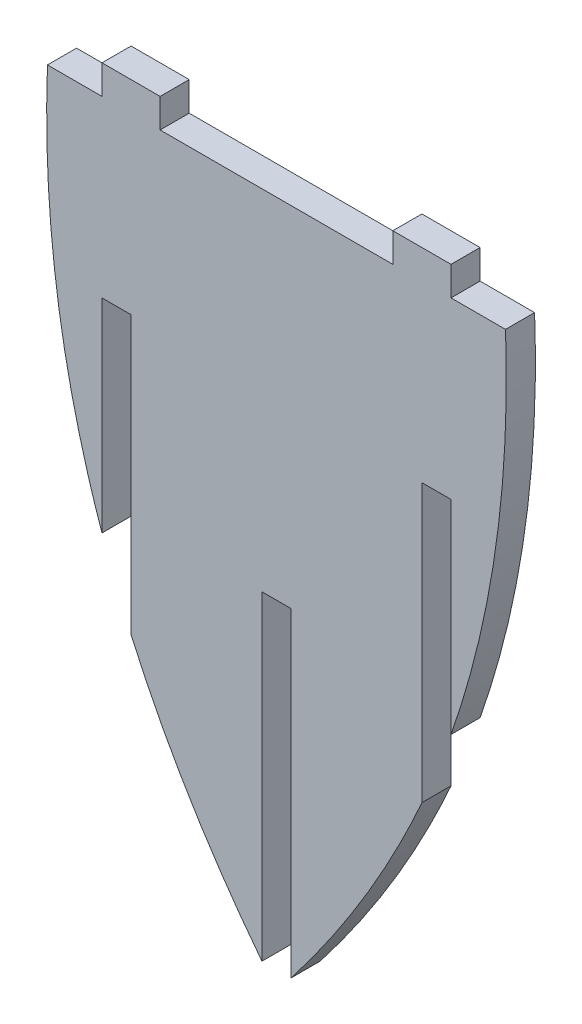
ISO-10303-21;
HEADER;
FILE_DESCRIPTION(('STEP AP214'),'2;1');
FILE_NAME('part.step','',(''),(''),'','','');
FILE_SCHEMA(('AUTOMOTIVE_DESIGN { 1 0 10303 214 1 1 1 1 }'));
ENDSEC;
DATA;
#1=APPLICATION_CONTEXT('core data for automotive mechanical design processes');
#2=APPLICATION_PROTOCOL_DEFINITION('international standard','automotive_design',2000,#1);
#3=PRODUCT_CONTEXT('',#1,'mechanical');
#4=PRODUCT('Part','Part','',(#3));
#5=PRODUCT_RELATED_PRODUCT_CATEGORY('part','',(#4));
#6=PRODUCT_DEFINITION_FORMATION('','',#4);
#7=PRODUCT_DEFINITION_CONTEXT('part definition',#1,'design');
#8=PRODUCT_DEFINITION('design','',#6,#7);
#9=PRODUCT_DEFINITION_SHAPE('','',#8);
#10=(LENGTH_UNIT() NAMED_UNIT(*) SI_UNIT(.MILLI.,.METRE.));
#11=(NAMED_UNIT(*) PLANE_ANGLE_UNIT() SI_UNIT($,.RADIAN.));
#12=(NAMED_UNIT(*) SI_UNIT($,.STERADIAN.) SOLID_ANGLE_UNIT());
#13=UNCERTAINTY_MEASURE_WITH_UNIT(LENGTH_MEASURE(1.E-05),#10,'distance_accuracy_value','');
#14=(GEOMETRIC_REPRESENTATION_CONTEXT(3) GLOBAL_UNCERTAINTY_ASSIGNED_CONTEXT((#13)) GLOBAL_UNIT_ASSIGNED_CONTEXT((#10,
#11,#12)) REPRESENTATION_CONTEXT('',''));
#15=CARTESIAN_POINT('',(0.,0.,0.));
#16=DIRECTION('',(0.,0.,1.));
#17=DIRECTION('',(1.,0.,0.));
#18=AXIS2_PLACEMENT_3D('',#15,#16,#17);
#19=CARTESIAN_POINT('',(-6.35,330.2,6.35));
#20=DIRECTION('',(0.,1.,0.));
#21=DIRECTION('',(0.,0.,1.));
#22=AXIS2_PLACEMENT_3D('',#19,#20,#21);
#23=PLANE('',#22);
#24=DIRECTION('',(1.,0.,0.));
#25=VECTOR('',#24,1.);
#26=CARTESIAN_POINT('',(-6.35,330.2,0.));
#27=LINE('',#26,#25);
#28=CARTESIAN_POINT('',(-6.35,330.2,0.));
#29=VERTEX_POINT('',#28);
#30=CARTESIAN_POINT('',(0.,330.2,0.));
#31=VERTEX_POINT('',#30);
#32=EDGE_CURVE('E328',#29,#31,#27,.T.);
#33=ORIENTED_EDGE('',*,*,#32,.T.);
#34=DIRECTION('',(0.,0.,-1.));
#35=VECTOR('',#34,1.);
#36=CARTESIAN_POINT('',(0.,330.2,6.35));
#37=LINE('',#36,#35);
#38=CARTESIAN_POINT('',(0.,330.2,6.35));
#39=VERTEX_POINT('',#38);
#40=EDGE_CURVE('E11',#39,#31,#37,.T.);
#41=ORIENTED_EDGE('',*,*,#40,.F.);
#42=DIRECTION('',(1.,0.,0.));
#43=VECTOR('',#42,1.);
#44=CARTESIAN_POINT('',(-6.35,330.2,6.35));
#45=LINE('',#44,#43);
#46=CARTESIAN_POINT('',(-6.35,330.2,6.35));
#47=VERTEX_POINT('',#46);
#48=EDGE_CURVE('E382',#47,#39,#45,.T.);
#49=ORIENTED_EDGE('',*,*,#48,.F.);
#50=DIRECTION('',(0.,0.,-1.));
#51=VECTOR('',#50,1.);
#52=CARTESIAN_POINT('',(-6.35,330.2,6.35));
#53=LINE('',#52,#51);
#54=EDGE_CURVE('E207',#47,#29,#53,.T.);
#55=ORIENTED_EDGE('',*,*,#54,.T.);
#56=EDGE_LOOP('',(#33,#41,#49,#55));
#57=FACE_BOUND('',#56,.T.);
#58=ADVANCED_FACE('F31',(#57),#23,.F.);
#59=CARTESIAN_POINT('',(0.,330.2,6.35));
#60=DIRECTION('',(1.,0.,0.));
#61=DIRECTION('',(0.,1.,0.));
#62=AXIS2_PLACEMENT_3D('',#59,#60,#61);
#63=PLANE('',#62);
#64=DIRECTION('',(0.,-1.,0.));
#65=VECTOR('',#64,1.);
#66=CARTESIAN_POINT('',(0.,330.2,0.));
#67=LINE('',#66,#65);
#68=CARTESIAN_POINT('',(0.,260.35,0.));
#69=VERTEX_POINT('',#68);
#70=EDGE_CURVE('E322',#31,#69,#67,.T.);
#71=ORIENTED_EDGE('',*,*,#70,.T.);
#72=DIRECTION('',(0.,0.,-1.));
#73=VECTOR('',#72,1.);
#74=CARTESIAN_POINT('',(0.,260.35,6.35));
#75=LINE('',#74,#73);
#76=CARTESIAN_POINT('',(0.,260.35,6.35));
#77=VERTEX_POINT('',#76);
#78=EDGE_CURVE('E39',#77,#69,#75,.T.);
#79=ORIENTED_EDGE('',*,*,#78,.F.);
#80=DIRECTION('',(0.,-1.,0.));
#81=VECTOR('',#80,1.);
#82=CARTESIAN_POINT('',(0.,330.2,6.35));
#83=LINE('',#82,#81);
#84=EDGE_CURVE('E132',#39,#77,#83,.T.);
#85=ORIENTED_EDGE('',*,*,#84,.F.);
#86=ORIENTED_EDGE('',*,*,#40,.T.);
#87=EDGE_LOOP('',(#71,#79,#85,#86));
#88=FACE_BOUND('',#87,.T.);
#89=ADVANCED_FACE('F403',(#88),#63,.F.);
#90=CARTESIAN_POINT('',(0.,260.35,6.35));
#91=CARTESIAN_POINT('',(17.5727422641235,282.971699720623,6.35));
#92=CARTESIAN_POINT('',(28.5750000002258,307.792730185393,6.35));
#93=B_SPLINE_CURVE_WITH_KNOTS('',2,(#90,#91,#92),.UNSPECIFIED.,.F.,.F.,(3,3),(0.647499935298557,
1.),.UNSPECIFIED.);
#94=DIRECTION('',(0.,0.,-1.));
#95=VECTOR('',#94,1.);
#96=SURFACE_OF_LINEAR_EXTRUSION('',#93,#95);
#97=CARTESIAN_POINT('',(0.,260.35,0.));
#98=CARTESIAN_POINT('',(17.5727422641235,282.971699720623,0.));
#99=CARTESIAN_POINT('',(28.5750000002258,307.792730185393,0.));
#100=B_SPLINE_CURVE_WITH_KNOTS('',2,(#97,#98,#99),.UNSPECIFIED.,.F.,.F.,(3,3),
(0.647499935298557,1.),.UNSPECIFIED.);
#101=CARTESIAN_POINT('',(28.5750000002258,307.792730185393,0.));
#102=VERTEX_POINT('',#101);
#103=EDGE_CURVE('E316',#69,#102,#100,.T.);
#104=ORIENTED_EDGE('',*,*,#103,.T.);
#105=DIRECTION('',(0.,0.,-1.));
#106=VECTOR('',#105,1.);
#107=CARTESIAN_POINT('',(28.5750000002258,307.792730185393,6.35));
#108=LINE('',#107,#106);
#109=CARTESIAN_POINT('',(28.5750000002258,307.792730185393,6.35));
#110=VERTEX_POINT('',#109);
#111=EDGE_CURVE('E308',#110,#102,#108,.T.);
#112=ORIENTED_EDGE('',*,*,#111,.F.);
#113=EDGE_CURVE('E317',#77,#110,#93,.T.);
#114=ORIENTED_EDGE('',*,*,#113,.F.);
#115=ORIENTED_EDGE('',*,*,#78,.T.);
#116=EDGE_LOOP('',(#104,#112,#114,#115));
#117=FACE_BOUND('',#116,.T.);
#118=ADVANCED_FACE('F314',(#117),#96,.F.);
#119=CARTESIAN_POINT('',(28.5750000002258,368.3,6.35));
#120=DIRECTION('',(-1.,0.,0.));
#121=DIRECTION('',(0.,-1.,0.));
#122=AXIS2_PLACEMENT_3D('',#119,#120,#121);
#123=PLANE('',#122);
#124=DIRECTION('',(0.,1.,0.));
#125=VECTOR('',#124,1.);
#126=CARTESIAN_POINT('',(28.5750000002258,368.3,0.));
#127=LINE('',#126,#125);
#128=CARTESIAN_POINT('',(28.5750000002258,368.3,0.));
#129=VERTEX_POINT('',#128);
#130=EDGE_CURVE('E324',#102,#129,#127,.T.);
#131=ORIENTED_EDGE('',*,*,#130,.T.);
#132=DIRECTION('',(0.,0.,-1.));
#133=VECTOR('',#132,1.);
#134=CARTESIAN_POINT('',(28.5750000002258,368.3,6.35));
#135=LINE('',#134,#133);
#136=CARTESIAN_POINT('',(28.5750000002258,368.3,6.35));
#137=VERTEX_POINT('',#136);
#138=EDGE_CURVE('E305',#137,#129,#135,.T.);
#139=ORIENTED_EDGE('',*,*,#138,.F.);
#140=DIRECTION('',(0.,1.,0.));
#141=VECTOR('',#140,1.);
#142=CARTESIAN_POINT('',(28.5750000002258,368.3,6.35));
#143=LINE('',#142,#141);
#144=EDGE_CURVE('E394',#110,#137,#143,.T.);
#145=ORIENTED_EDGE('',*,*,#144,.F.);
#146=ORIENTED_EDGE('',*,*,#111,.T.);
#147=EDGE_LOOP('',(#131,#139,#145,#146));
#148=FACE_BOUND('',#147,.T.);
#149=ADVANCED_FACE('F402',(#148),#123,.F.);
#150=CARTESIAN_POINT('',(34.9250000002258,368.3,6.35));
#151=DIRECTION('',(0.,1.,0.));
#152=DIRECTION('',(0.,0.,1.));
#153=AXIS2_PLACEMENT_3D('',#150,#151,#152);
#154=PLANE('',#153);
#155=DIRECTION('',(1.,0.,0.));
#156=VECTOR('',#155,1.);
#157=CARTESIAN_POINT('',(34.9250000002258,368.3,0.));
#158=LINE('',#157,#156);
#159=CARTESIAN_POINT('',(34.9250000002258,368.3,0.));
#160=VERTEX_POINT('',#159);
#161=EDGE_CURVE('E326',#129,#160,#158,.T.);
#162=ORIENTED_EDGE('',*,*,#161,.T.);
#163=DIRECTION('',(0.,0.,-1.));
#164=VECTOR('',#163,1.);
#165=CARTESIAN_POINT('',(34.9250000002258,368.3,6.35));
#166=LINE('',#165,#164);
#167=CARTESIAN_POINT('',(34.9250000002258,368.3,6.35));
#168=VERTEX_POINT('',#167);
#169=EDGE_CURVE('E302',#168,#160,#166,.T.);
#170=ORIENTED_EDGE('',*,*,#169,.F.);
#171=DIRECTION('',(1.,0.,0.));
#172=VECTOR('',#171,1.);
#173=CARTESIAN_POINT('',(34.9250000002258,368.3,6.35));
#174=LINE('',#173,#172);
#175=EDGE_CURVE('E647',#137,#168,#174,.T.);
#176=ORIENTED_EDGE('',*,*,#175,.F.);
#177=ORIENTED_EDGE('',*,*,#138,.T.);
#178=EDGE_LOOP('',(#162,#170,#176,#177));
#179=FACE_BOUND('',#178,.T.);
#180=ADVANCED_FACE('F430',(#179),#154,.F.);
#181=CARTESIAN_POINT('',(34.925,323.85,6.35));
#182=DIRECTION('',(1.,-5.08092505701625E-12,0.));
#183=DIRECTION('',(5.08092505701625E-12,1.,0.));
#184=AXIS2_PLACEMENT_3D('',#181,#182,#183);
#185=PLANE('',#184);
#186=DIRECTION('',(-5.08092505701625E-12,-1.,0.));
#187=VECTOR('',#186,1.);
#188=CARTESIAN_POINT('',(34.925,323.85,0.));
#189=LINE('',#188,#187);
#190=CARTESIAN_POINT('',(34.925,323.85,0.));
#191=VERTEX_POINT('',#190);
#192=EDGE_CURVE('E337',#160,#191,#189,.T.);
#193=ORIENTED_EDGE('',*,*,#192,.T.);
#194=DIRECTION('',(0.,0.,-1.));
#195=VECTOR('',#194,1.);
#196=CARTESIAN_POINT('',(34.925,323.85,6.35));
#197=LINE('',#196,#195);
#198=CARTESIAN_POINT('',(34.925,323.85,6.35));
#199=VERTEX_POINT('',#198);
#200=EDGE_CURVE('E299',#199,#191,#197,.T.);
#201=ORIENTED_EDGE('',*,*,#200,.F.);
#202=DIRECTION('',(-5.08092505701625E-12,-1.,0.));
#203=VECTOR('',#202,1.);
#204=CARTESIAN_POINT('',(34.925,323.85,6.35));
#205=LINE('',#204,#203);
#206=EDGE_CURVE('E643',#168,#199,#205,.T.);
#207=ORIENTED_EDGE('',*,*,#206,.F.);
#208=ORIENTED_EDGE('',*,*,#169,.T.);
#209=EDGE_LOOP('',(#193,#201,#207,#208));
#210=FACE_BOUND('',#209,.T.);
#211=ADVANCED_FACE('F439',(#210),#185,.F.);
#212=CARTESIAN_POINT('',(34.925,323.85,6.35));
#213=CARTESIAN_POINT('',(48.4445147876115,362.591265004155,6.35));
#214=CARTESIAN_POINT('',(46.825,406.4,6.35));
#215=B_SPLINE_CURVE_WITH_KNOTS('',2,(#212,#213,#214),.UNSPECIFIED.,.F.,.F.,(3,3),(0.,
0.535068668625723),.UNSPECIFIED.);
#216=DIRECTION('',(0.,0.,-1.));
#217=VECTOR('',#216,1.);
#218=SURFACE_OF_LINEAR_EXTRUSION('',#215,#217);
#219=CARTESIAN_POINT('',(34.925,323.85,0.));
#220=CARTESIAN_POINT('',(48.4445147876115,362.591265004155,0.));
#221=CARTESIAN_POINT('',(46.825,406.4,0.));
#222=B_SPLINE_CURVE_WITH_KNOTS('',2,(#219,#220,#221),.UNSPECIFIED.,.F.,.F.,(3,3),(0.,
0.535068668625723),.UNSPECIFIED.);
#223=CARTESIAN_POINT('',(46.825,406.4,0.));
#224=VERTEX_POINT('',#223);
#225=EDGE_CURVE('E339',#191,#224,#222,.T.);
#226=ORIENTED_EDGE('',*,*,#225,.T.);
#227=DIRECTION('',(0.,0.,-1.));
#228=VECTOR('',#227,1.);
#229=CARTESIAN_POINT('',(46.825,406.4,6.35));
#230=LINE('',#229,#228);
#231=CARTESIAN_POINT('',(46.825,406.4,6.35));
#232=VERTEX_POINT('',#231);
#233=EDGE_CURVE('E296',#232,#224,#230,.T.);
#234=ORIENTED_EDGE('',*,*,#233,.F.);
#235=EDGE_CURVE('E638',#199,#232,#215,.T.);
#236=ORIENTED_EDGE('',*,*,#235,.F.);
#237=ORIENTED_EDGE('',*,*,#200,.T.);
#238=EDGE_LOOP('',(#226,#234,#236,#237));
#239=FACE_BOUND('',#238,.T.);
#240=ADVANCED_FACE('F448',(#239),#218,.F.);
#241=CARTESIAN_POINT('',(34.925,406.4,6.35));
#242=DIRECTION('',(0.,-1.,0.));
#243=DIRECTION('',(0.,0.,-1.));
#244=AXIS2_PLACEMENT_3D('',#241,#242,#243);
#245=PLANE('',#244);
#246=DIRECTION('',(-1.,0.,0.));
#247=VECTOR('',#246,1.);
#248=CARTESIAN_POINT('',(34.925,406.4,0.));
#249=LINE('',#248,#247);
#250=CARTESIAN_POINT('',(34.925,406.4,0.));
#251=VERTEX_POINT('',#250);
#252=EDGE_CURVE('E343',#224,#251,#249,.T.);
#253=ORIENTED_EDGE('',*,*,#252,.T.);
#254=DIRECTION('',(0.,0.,-1.));
#255=VECTOR('',#254,1.);
#256=CARTESIAN_POINT('',(34.925,406.4,6.35));
#257=LINE('',#256,#255);
#258=CARTESIAN_POINT('',(34.925,406.4,6.35));
#259=VERTEX_POINT('',#258);
#260=EDGE_CURVE('E293',#259,#251,#257,.T.);
#261=ORIENTED_EDGE('',*,*,#260,.F.);
#262=DIRECTION('',(-1.,0.,0.));
#263=VECTOR('',#262,1.);
#264=CARTESIAN_POINT('',(34.925,406.4,6.35));
#265=LINE('',#264,#263);
#266=EDGE_CURVE('E636',#232,#259,#265,.T.);
#267=ORIENTED_EDGE('',*,*,#266,.F.);
#268=ORIENTED_EDGE('',*,*,#233,.T.);
#269=EDGE_LOOP('',(#253,#261,#267,#268));
#270=FACE_BOUND('',#269,.T.);
#271=ADVANCED_FACE('F458',(#270),#245,.F.);
#272=CARTESIAN_POINT('',(34.925,406.4,6.35));
#273=DIRECTION('',(-1.,0.,0.));
#274=DIRECTION('',(0.,0.,1.));
#275=AXIS2_PLACEMENT_3D('',#272,#273,#274);
#276=PLANE('',#275);
#277=DIRECTION('',(0.,1.,0.));
#278=VECTOR('',#277,1.);
#279=CARTESIAN_POINT('',(34.925,406.4,0.));
#280=LINE('',#279,#278);
#281=CARTESIAN_POINT('',(34.925,412.75,0.));
#282=VERTEX_POINT('',#281);
#283=EDGE_CURVE('E348',#251,#282,#280,.T.);
#284=ORIENTED_EDGE('',*,*,#283,.T.);
#285=DIRECTION('',(0.,0.,-1.));
#286=VECTOR('',#285,1.);
#287=CARTESIAN_POINT('',(34.925,412.75,6.35));
#288=LINE('',#287,#286);
#289=CARTESIAN_POINT('',(34.925,412.75,6.35));
#290=VERTEX_POINT('',#289);
#291=EDGE_CURVE('E290',#290,#282,#288,.T.);
#292=ORIENTED_EDGE('',*,*,#291,.F.);
#293=DIRECTION('',(0.,1.,0.));
#294=VECTOR('',#293,1.);
#295=CARTESIAN_POINT('',(34.925,406.4,6.35));
#296=LINE('',#295,#294);
#297=EDGE_CURVE('E634',#259,#290,#296,.T.);
#298=ORIENTED_EDGE('',*,*,#297,.F.);
#299=ORIENTED_EDGE('',*,*,#260,.T.);
#300=EDGE_LOOP('',(#284,#292,#298,#299));
#301=FACE_BOUND('',#300,.T.);
#302=ADVANCED_FACE('F468',(#301),#276,.F.);
#303=CARTESIAN_POINT('',(22.225,412.75,6.35));
#304=DIRECTION('',(0.,-1.,0.));
#305=DIRECTION('',(0.,0.,-1.));
#306=AXIS2_PLACEMENT_3D('',#303,#304,#305);
#307=PLANE('',#306);
#308=DIRECTION('',(-1.,0.,0.));
#309=VECTOR('',#308,1.);
#310=CARTESIAN_POINT('',(22.225,412.75,0.));
#311=LINE('',#310,#309);
#312=CARTESIAN_POINT('',(22.225,412.75,0.));
#313=VERTEX_POINT('',#312);
#314=EDGE_CURVE('E350',#282,#313,#311,.T.);
#315=ORIENTED_EDGE('',*,*,#314,.T.);
#316=DIRECTION('',(0.,0.,-1.));
#317=VECTOR('',#316,1.);
#318=CARTESIAN_POINT('',(22.225,412.75,6.35));
#319=LINE('',#318,#317);
#320=CARTESIAN_POINT('',(22.225,412.75,6.35));
#321=VERTEX_POINT('',#320);
#322=EDGE_CURVE('E287',#321,#313,#319,.T.);
#323=ORIENTED_EDGE('',*,*,#322,.F.);
#324=DIRECTION('',(-1.,0.,0.));
#325=VECTOR('',#324,1.);
#326=CARTESIAN_POINT('',(22.225,412.75,6.35));
#327=LINE('',#326,#325);
#328=EDGE_CURVE('E629',#290,#321,#327,.T.);
#329=ORIENTED_EDGE('',*,*,#328,.F.);
#330=ORIENTED_EDGE('',*,*,#291,.T.);
#331=EDGE_LOOP('',(#315,#323,#329,#330));
#332=FACE_BOUND('',#331,.T.);
#333=ADVANCED_FACE('F478',(#332),#307,.F.);
#334=CARTESIAN_POINT('',(22.225,412.75,6.35));
#335=DIRECTION('',(1.,0.,0.));
#336=DIRECTION('',(0.,0.,-1.));
#337=AXIS2_PLACEMENT_3D('',#334,#335,#336);
#338=PLANE('',#337);
#339=DIRECTION('',(0.,-1.,0.));
#340=VECTOR('',#339,1.);
#341=CARTESIAN_POINT('',(22.225,412.75,0.));
#342=LINE('',#341,#340);
#343=CARTESIAN_POINT('',(22.225,406.4,0.));
#344=VERTEX_POINT('',#343);
#345=EDGE_CURVE('E352',#313,#344,#342,.T.);
#346=ORIENTED_EDGE('',*,*,#345,.T.);
#347=DIRECTION('',(0.,0.,-1.));
#348=VECTOR('',#347,1.);
#349=CARTESIAN_POINT('',(22.225,406.4,6.35));
#350=LINE('',#349,#348);
#351=CARTESIAN_POINT('',(22.225,406.4,6.35));
#352=VERTEX_POINT('',#351);
#353=EDGE_CURVE('E284',#352,#344,#350,.T.);
#354=ORIENTED_EDGE('',*,*,#353,.F.);
#355=DIRECTION('',(0.,-1.,0.));
#356=VECTOR('',#355,1.);
#357=CARTESIAN_POINT('',(22.225,412.75,6.35));
#358=LINE('',#357,#356);
#359=EDGE_CURVE('E626',#321,#352,#358,.T.);
#360=ORIENTED_EDGE('',*,*,#359,.F.);
#361=ORIENTED_EDGE('',*,*,#322,.T.);
#362=EDGE_LOOP('',(#346,#354,#360,#361));
#363=FACE_BOUND('',#362,.T.);
#364=ADVANCED_FACE('F488',(#363),#338,.F.);
#365=CARTESIAN_POINT('',(-28.575,406.4,6.35));
#366=DIRECTION('',(0.,-1.,0.));
#367=DIRECTION('',(1.,0.,0.));
#368=AXIS2_PLACEMENT_3D('',#365,#366,#367);
#369=PLANE('',#368);
#370=DIRECTION('',(-1.,0.,0.));
#371=VECTOR('',#370,1.);
#372=CARTESIAN_POINT('',(-28.575,406.4,0.));
#373=LINE('',#372,#371);
#374=CARTESIAN_POINT('',(-28.575,406.4,0.));
#375=VERTEX_POINT('',#374);
#376=EDGE_CURVE('E355',#344,#375,#373,.T.);
#377=ORIENTED_EDGE('',*,*,#376,.T.);
#378=DIRECTION('',(0.,0.,-1.));
#379=VECTOR('',#378,1.);
#380=CARTESIAN_POINT('',(-28.575,406.4,6.35));
#381=LINE('',#380,#379);
#382=CARTESIAN_POINT('',(-28.575,406.4,6.35));
#383=VERTEX_POINT('',#382);
#384=EDGE_CURVE('E281',#383,#375,#381,.T.);
#385=ORIENTED_EDGE('',*,*,#384,.F.);
#386=DIRECTION('',(-1.,0.,0.));
#387=VECTOR('',#386,1.);
#388=CARTESIAN_POINT('',(22.225,406.4,6.35));
#389=LINE('',#388,#387);
#390=EDGE_CURVE('E625',#352,#383,#389,.T.);
#391=ORIENTED_EDGE('',*,*,#390,.F.);
#392=ORIENTED_EDGE('',*,*,#353,.T.);
#393=EDGE_LOOP('',(#377,#385,#391,#392));
#394=FACE_BOUND('',#393,.T.);
#395=ADVANCED_FACE('F498',(#394),#369,.F.);
#396=CARTESIAN_POINT('',(-28.575,412.75,6.35));
#397=DIRECTION('',(-1.,0.,0.));
#398=DIRECTION('',(0.,0.,1.));
#399=AXIS2_PLACEMENT_3D('',#396,#397,#398);
#400=PLANE('',#399);
#401=DIRECTION('',(0.,1.,0.));
#402=VECTOR('',#401,1.);
#403=CARTESIAN_POINT('',(-28.575,412.75,0.));
#404=LINE('',#403,#402);
#405=CARTESIAN_POINT('',(-28.575,412.75,0.));
#406=VERTEX_POINT('',#405);
#407=EDGE_CURVE('E357',#375,#406,#404,.T.);
#408=ORIENTED_EDGE('',*,*,#407,.T.);
#409=DIRECTION('',(0.,0.,-1.));
#410=VECTOR('',#409,1.);
#411=CARTESIAN_POINT('',(-28.575,412.75,6.35));
#412=LINE('',#411,#410);
#413=CARTESIAN_POINT('',(-28.575,412.75,6.35));
#414=VERTEX_POINT('',#413);
#415=EDGE_CURVE('E278',#414,#406,#412,.T.);
#416=ORIENTED_EDGE('',*,*,#415,.F.);
#417=DIRECTION('',(0.,1.,0.));
#418=VECTOR('',#417,1.);
#419=CARTESIAN_POINT('',(-28.575,412.75,6.35));
#420=LINE('',#419,#418);
#421=EDGE_CURVE('E617',#383,#414,#420,.T.);
#422=ORIENTED_EDGE('',*,*,#421,.F.);
#423=ORIENTED_EDGE('',*,*,#384,.T.);
#424=EDGE_LOOP('',(#408,#416,#422,#423));
#425=FACE_BOUND('',#424,.T.);
#426=ADVANCED_FACE('F509',(#425),#400,.F.);
#427=CARTESIAN_POINT('',(-41.275,412.75,6.35));
#428=DIRECTION('',(0.,-1.,0.));
#429=DIRECTION('',(0.,0.,-1.));
#430=AXIS2_PLACEMENT_3D('',#427,#428,#429);
#431=PLANE('',#430);
#432=DIRECTION('',(-1.,0.,0.));
#433=VECTOR('',#432,1.);
#434=CARTESIAN_POINT('',(-41.275,412.75,0.));
#435=LINE('',#434,#433);
#436=CARTESIAN_POINT('',(-41.275,412.75,0.));
#437=VERTEX_POINT('',#436);
#438=EDGE_CURVE('E359',#406,#437,#435,.T.);
#439=ORIENTED_EDGE('',*,*,#438,.T.);
#440=DIRECTION('',(0.,0.,-1.));
#441=VECTOR('',#440,1.);
#442=CARTESIAN_POINT('',(-41.275,412.75,6.35));
#443=LINE('',#442,#441);
#444=CARTESIAN_POINT('',(-41.275,412.75,6.35));
#445=VERTEX_POINT('',#444);
#446=EDGE_CURVE('E275',#445,#437,#443,.T.);
#447=ORIENTED_EDGE('',*,*,#446,.F.);
#448=DIRECTION('',(-1.,0.,0.));
#449=VECTOR('',#448,1.);
#450=CARTESIAN_POINT('',(-41.275,412.75,6.35));
#451=LINE('',#450,#449);
#452=EDGE_CURVE('E614',#414,#445,#451,.T.);
#453=ORIENTED_EDGE('',*,*,#452,.F.);
#454=ORIENTED_EDGE('',*,*,#415,.T.);
#455=EDGE_LOOP('',(#439,#447,#453,#454));
#456=FACE_BOUND('',#455,.T.);
#457=ADVANCED_FACE('F519',(#456),#431,.F.);
#458=CARTESIAN_POINT('',(-41.275,406.4,6.35));
#459=DIRECTION('',(1.,0.,0.));
#460=DIRECTION('',(0.,0.,-1.));
#461=AXIS2_PLACEMENT_3D('',#458,#459,#460);
#462=PLANE('',#461);
#463=DIRECTION('',(0.,-1.,0.));
#464=VECTOR('',#463,1.);
#465=CARTESIAN_POINT('',(-41.275,406.4,0.));
#466=LINE('',#465,#464);
#467=CARTESIAN_POINT('',(-41.275,406.4,0.));
#468=VERTEX_POINT('',#467);
#469=EDGE_CURVE('E361',#437,#468,#466,.T.);
#470=ORIENTED_EDGE('',*,*,#469,.T.);
#471=DIRECTION('',(0.,0.,-1.));
#472=VECTOR('',#471,1.);
#473=CARTESIAN_POINT('',(-41.275,406.4,6.35));
#474=LINE('',#473,#472);
#475=CARTESIAN_POINT('',(-41.275,406.4,6.35));
#476=VERTEX_POINT('',#475);
#477=EDGE_CURVE('E272',#476,#468,#474,.T.);
#478=ORIENTED_EDGE('',*,*,#477,.F.);
#479=DIRECTION('',(0.,-1.,0.));
#480=VECTOR('',#479,1.);
#481=CARTESIAN_POINT('',(-41.275,406.4,6.35));
#482=LINE('',#481,#480);
#483=EDGE_CURVE('E612',#445,#476,#482,.T.);
#484=ORIENTED_EDGE('',*,*,#483,.F.);
#485=ORIENTED_EDGE('',*,*,#446,.T.);
#486=EDGE_LOOP('',(#470,#478,#484,#485));
#487=FACE_BOUND('',#486,.T.);
#488=ADVANCED_FACE('F529',(#487),#462,.F.);
#489=CARTESIAN_POINT('',(-53.175,406.4,6.35));
#490=DIRECTION('',(0.,-1.,0.));
#491=DIRECTION('',(0.,0.,-1.));
#492=AXIS2_PLACEMENT_3D('',#489,#490,#491);
#493=PLANE('',#492);
#494=DIRECTION('',(-1.,0.,0.));
#495=VECTOR('',#494,1.);
#496=CARTESIAN_POINT('',(-53.175,406.4,0.));
#497=LINE('',#496,#495);
#498=CARTESIAN_POINT('',(-53.175,406.4,0.));
#499=VERTEX_POINT('',#498);
#500=EDGE_CURVE('E363',#468,#499,#497,.T.);
#501=ORIENTED_EDGE('',*,*,#500,.T.);
#502=DIRECTION('',(0.,0.,-1.));
#503=VECTOR('',#502,1.);
#504=CARTESIAN_POINT('',(-53.175,406.4,6.35));
#505=LINE('',#504,#503);
#506=CARTESIAN_POINT('',(-53.175,406.4,6.35));
#507=VERTEX_POINT('',#506);
#508=EDGE_CURVE('E269',#507,#499,#505,.T.);
#509=ORIENTED_EDGE('',*,*,#508,.F.);
#510=DIRECTION('',(-1.,0.,0.));
#511=VECTOR('',#510,1.);
#512=CARTESIAN_POINT('',(-53.175,406.4,6.35));
#513=LINE('',#512,#511);
#514=EDGE_CURVE('E247',#476,#507,#513,.T.);
#515=ORIENTED_EDGE('',*,*,#514,.F.);
#516=ORIENTED_EDGE('',*,*,#477,.T.);
#517=EDGE_LOOP('',(#501,#509,#515,#516));
#518=FACE_BOUND('',#517,.T.);
#519=ADVANCED_FACE('F237',(#518),#493,.F.);
#520=CARTESIAN_POINT('',(-53.175,406.4,6.35));
#521=CARTESIAN_POINT('',(-54.7945147876116,362.591265004154,6.35));
#522=CARTESIAN_POINT('',(-41.275,323.85,6.35));
#523=B_SPLINE_CURVE_WITH_KNOTS('',2,(#520,#521,#522),.UNSPECIFIED.,.F.,.F.,(3,3),(0.,
0.535068668625723),.UNSPECIFIED.);
#524=DIRECTION('',(0.,0.,-1.));
#525=VECTOR('',#524,1.);
#526=SURFACE_OF_LINEAR_EXTRUSION('',#523,#525);
#527=CARTESIAN_POINT('',(-53.175,406.4,0.));
#528=CARTESIAN_POINT('',(-54.7945147876116,362.591265004154,0.));
#529=CARTESIAN_POINT('',(-41.275,323.85,0.));
#530=B_SPLINE_CURVE_WITH_KNOTS('',2,(#527,#528,#529),.UNSPECIFIED.,.F.,.F.,(3,3),(0.,
0.535068668625723),.UNSPECIFIED.);
#531=CARTESIAN_POINT('',(-41.275,323.85,0.));
#532=VERTEX_POINT('',#531);
#533=EDGE_CURVE('E365',#499,#532,#530,.T.);
#534=ORIENTED_EDGE('',*,*,#533,.T.);
#535=DIRECTION('',(0.,0.,-1.));
#536=VECTOR('',#535,1.);
#537=CARTESIAN_POINT('',(-41.275,323.85,6.35));
#538=LINE('',#537,#536);
#539=CARTESIAN_POINT('',(-41.275,323.85,6.35));
#540=VERTEX_POINT('',#539);
#541=EDGE_CURVE('E262',#540,#532,#538,.T.);
#542=ORIENTED_EDGE('',*,*,#541,.F.);
#543=EDGE_CURVE('E240',#507,#540,#523,.T.);
#544=ORIENTED_EDGE('',*,*,#543,.F.);
#545=ORIENTED_EDGE('',*,*,#508,.T.);
#546=EDGE_LOOP('',(#534,#542,#544,#545));
#547=FACE_BOUND('',#546,.T.);
#548=ADVANCED_FACE('F232',(#547),#526,.F.);
#549=CARTESIAN_POINT('',(-41.275,323.85,6.35));
#550=DIRECTION('',(-1.,-5.08092505701625E-12,0.));
#551=DIRECTION('',(5.08092505701625E-12,-1.,0.));
#552=AXIS2_PLACEMENT_3D('',#549,#550,#551);
#553=PLANE('',#552);
#554=DIRECTION('',(-5.08092505701625E-12,1.,0.));
#555=VECTOR('',#554,1.);
#556=CARTESIAN_POINT('',(-41.275,323.85,0.));
#557=LINE('',#556,#555);
#558=CARTESIAN_POINT('',(-41.2750000002259,368.3,0.));
#559=VERTEX_POINT('',#558);
#560=EDGE_CURVE('E260',#532,#559,#557,.T.);
#561=ORIENTED_EDGE('',*,*,#560,.T.);
#562=DIRECTION('',(0.,0.,-1.));
#563=VECTOR('',#562,1.);
#564=CARTESIAN_POINT('',(-41.2750000002259,368.3,6.35));
#565=LINE('',#564,#563);
#566=CARTESIAN_POINT('',(-41.2750000002259,368.3,6.35));
#567=VERTEX_POINT('',#566);
#568=EDGE_CURVE('E258',#567,#559,#565,.T.);
#569=ORIENTED_EDGE('',*,*,#568,.F.);
#570=DIRECTION('',(-5.08092505701625E-12,1.,0.));
#571=VECTOR('',#570,1.);
#572=CARTESIAN_POINT('',(-41.275,323.85,6.35));
#573=LINE('',#572,#571);
#574=EDGE_CURVE('E246',#540,#567,#573,.T.);
#575=ORIENTED_EDGE('',*,*,#574,.F.);
#576=ORIENTED_EDGE('',*,*,#541,.T.);
#577=EDGE_LOOP('',(#561,#569,#575,#576));
#578=FACE_BOUND('',#577,.T.);
#579=ADVANCED_FACE('F228',(#578),#553,.F.);
#580=CARTESIAN_POINT('',(-41.2750000002259,368.3,6.35));
#581=DIRECTION('',(0.,1.,0.));
#582=DIRECTION('',(0.,0.,1.));
#583=AXIS2_PLACEMENT_3D('',#580,#581,#582);
#584=PLANE('',#583);
#585=DIRECTION('',(1.,0.,0.));
#586=VECTOR('',#585,1.);
#587=CARTESIAN_POINT('',(-41.2750000002259,368.3,0.));
#588=LINE('',#587,#586);
#589=CARTESIAN_POINT('',(-34.9250000002259,368.3,0.));
#590=VERTEX_POINT('',#589);
#591=EDGE_CURVE('E264',#559,#590,#588,.T.);
#592=ORIENTED_EDGE('',*,*,#591,.T.);
#593=DIRECTION('',(0.,0.,-1.));
#594=VECTOR('',#593,1.);
#595=CARTESIAN_POINT('',(-34.9250000002259,368.3,6.35));
#596=LINE('',#595,#594);
#597=CARTESIAN_POINT('',(-34.9250000002259,368.3,6.35));
#598=VERTEX_POINT('',#597);
#599=EDGE_CURVE('E202',#598,#590,#596,.T.);
#600=ORIENTED_EDGE('',*,*,#599,.F.);
#601=DIRECTION('',(1.,0.,0.));
#602=VECTOR('',#601,1.);
#603=CARTESIAN_POINT('',(-41.2750000002259,368.3,6.35));
#604=LINE('',#603,#602);
#605=EDGE_CURVE('E193',#567,#598,#604,.T.);
#606=ORIENTED_EDGE('',*,*,#605,.F.);
#607=ORIENTED_EDGE('',*,*,#568,.T.);
#608=EDGE_LOOP('',(#592,#600,#606,#607));
#609=FACE_BOUND('',#608,.T.);
#610=ADVANCED_FACE('F225',(#609),#584,.F.);
#611=CARTESIAN_POINT('',(-34.9250000002259,368.3,6.35));
#612=DIRECTION('',(1.,0.,0.));
#613=DIRECTION('',(0.,1.,0.));
#614=AXIS2_PLACEMENT_3D('',#611,#612,#613);
#615=PLANE('',#614);
#616=DIRECTION('',(0.,-1.,0.));
#617=VECTOR('',#616,1.);
#618=CARTESIAN_POINT('',(-34.9250000002259,368.3,0.));
#619=LINE('',#618,#617);
#620=CARTESIAN_POINT('',(-34.9250000002259,307.792730185393,0.));
#621=VERTEX_POINT('',#620);
#622=EDGE_CURVE('E201',#590,#621,#619,.T.);
#623=ORIENTED_EDGE('',*,*,#622,.T.);
#624=DIRECTION('',(0.,0.,-1.));
#625=VECTOR('',#624,1.);
#626=CARTESIAN_POINT('',(-34.9250000002259,307.792730185393,6.35));
#627=LINE('',#626,#625);
#628=CARTESIAN_POINT('',(-34.9250000002259,307.792730185393,6.35));
#629=VERTEX_POINT('',#628);
#630=EDGE_CURVE('E198',#629,#621,#627,.T.);
#631=ORIENTED_EDGE('',*,*,#630,.F.);
#632=DIRECTION('',(0.,-1.,0.));
#633=VECTOR('',#632,1.);
#634=CARTESIAN_POINT('',(-34.9250000002259,368.3,6.35));
#635=LINE('',#634,#633);
#636=EDGE_CURVE('E187',#598,#629,#635,.T.);
#637=ORIENTED_EDGE('',*,*,#636,.F.);
#638=ORIENTED_EDGE('',*,*,#599,.T.);
#639=EDGE_LOOP('',(#623,#631,#637,#638));
#640=FACE_BOUND('',#639,.T.);
#641=ADVANCED_FACE('F199',(#640),#615,.F.);
#642=CARTESIAN_POINT('',(-34.9250000002259,307.792730185393,6.35));
#643=CARTESIAN_POINT('',(-23.9227422641233,282.971699720622,6.35));
#644=CARTESIAN_POINT('',(-6.35,260.35,6.35));
#645=B_SPLINE_CURVE_WITH_KNOTS('',2,(#642,#643,#644),.UNSPECIFIED.,.F.,.F.,(3,3),
(0.647499935298544,1.),.UNSPECIFIED.);
#646=DIRECTION('',(0.,0.,-1.));
#647=VECTOR('',#646,1.);
#648=SURFACE_OF_LINEAR_EXTRUSION('',#645,#647);
#649=CARTESIAN_POINT('',(-34.9250000002259,307.792730185393,0.));
#650=CARTESIAN_POINT('',(-23.9227422641233,282.971699720622,0.));
#651=CARTESIAN_POINT('',(-6.35,260.35,0.));
#652=B_SPLINE_CURVE_WITH_KNOTS('',2,(#649,#650,#651),.UNSPECIFIED.,.F.,.F.,(3,3),
(0.647499935298544,1.),.UNSPECIFIED.);
#653=CARTESIAN_POINT('',(-6.35,260.35,0.));
#654=VERTEX_POINT('',#653);
#655=EDGE_CURVE('E118',#621,#654,#652,.T.);
#656=ORIENTED_EDGE('',*,*,#655,.T.);
#657=DIRECTION('',(0.,0.,-1.));
#658=VECTOR('',#657,1.);
#659=CARTESIAN_POINT('',(-6.35,260.35,6.35));
#660=LINE('',#659,#658);
#661=CARTESIAN_POINT('',(-6.35,260.35,6.35));
#662=VERTEX_POINT('',#661);
#663=EDGE_CURVE('E203',#662,#654,#660,.T.);
#664=ORIENTED_EDGE('',*,*,#663,.F.);
#665=EDGE_CURVE('E191',#629,#662,#645,.T.);
#666=ORIENTED_EDGE('',*,*,#665,.F.);
#667=ORIENTED_EDGE('',*,*,#630,.T.);
#668=EDGE_LOOP('',(#656,#664,#666,#667));
#669=FACE_BOUND('',#668,.T.);
#670=ADVANCED_FACE('F205',(#669),#648,.F.);
#671=CARTESIAN_POINT('',(-6.35,260.35,6.35));
#672=DIRECTION('',(-1.,0.,0.));
#673=DIRECTION('',(0.,-1.,0.));
#674=AXIS2_PLACEMENT_3D('',#671,#672,#673);
#675=PLANE('',#674);
#676=DIRECTION('',(0.,1.,0.));
#677=VECTOR('',#676,1.);
#678=CARTESIAN_POINT('',(-6.35,260.35,0.));
#679=LINE('',#678,#677);
#680=EDGE_CURVE('E124',#654,#29,#679,.T.);
#681=ORIENTED_EDGE('',*,*,#680,.T.);
#682=ORIENTED_EDGE('',*,*,#54,.F.);
#683=DIRECTION('',(0.,1.,0.));
#684=VECTOR('',#683,1.);
#685=CARTESIAN_POINT('',(-6.35,260.35,6.35));
#686=LINE('',#685,#684);
#687=EDGE_CURVE('E47',#662,#47,#686,.T.);
#688=ORIENTED_EDGE('',*,*,#687,.F.);
#689=ORIENTED_EDGE('',*,*,#663,.T.);
#690=EDGE_LOOP('',(#681,#682,#688,#689));
#691=FACE_BOUND('',#690,.T.);
#692=ADVANCED_FACE('F221',(#691),#675,.F.);
#693=CARTESIAN_POINT('',(15.9301211321182,283.52153240666,6.35));
#694=DIRECTION('',(0.,0.,1.));
#695=DIRECTION('',(1.,0.,0.));
#696=AXIS2_PLACEMENT_3D('',#693,#694,#695);
#697=PLANE('',#696);
#698=ORIENTED_EDGE('',*,*,#48,.T.);
#699=ORIENTED_EDGE('',*,*,#84,.T.);
#700=ORIENTED_EDGE('',*,*,#113,.T.);
#701=ORIENTED_EDGE('',*,*,#144,.T.);
#702=ORIENTED_EDGE('',*,*,#175,.T.);
#703=ORIENTED_EDGE('',*,*,#206,.T.);
#704=ORIENTED_EDGE('',*,*,#235,.T.);
#705=ORIENTED_EDGE('',*,*,#266,.T.);
#706=ORIENTED_EDGE('',*,*,#297,.T.);
#707=ORIENTED_EDGE('',*,*,#328,.T.);
#708=ORIENTED_EDGE('',*,*,#359,.T.);
#709=ORIENTED_EDGE('',*,*,#390,.T.);
#710=ORIENTED_EDGE('',*,*,#421,.T.);
#711=ORIENTED_EDGE('',*,*,#452,.T.);
#712=ORIENTED_EDGE('',*,*,#483,.T.);
#713=ORIENTED_EDGE('',*,*,#514,.T.);
#714=ORIENTED_EDGE('',*,*,#543,.T.);
#715=ORIENTED_EDGE('',*,*,#574,.T.);
#716=ORIENTED_EDGE('',*,*,#605,.T.);
#717=ORIENTED_EDGE('',*,*,#636,.T.);
#718=ORIENTED_EDGE('',*,*,#665,.T.);
#719=ORIENTED_EDGE('',*,*,#687,.T.);
#720=EDGE_LOOP('',(#698,#699,#700,#701,#702,#703,#704,#705,#706,#707,#708,#709,#710,#711,#712,
#713,#714,#715,#716,#717,#718,#719));
#721=FACE_BOUND('',#720,.T.);
#722=ADVANCED_FACE('F189',(#721),#697,.T.);
#723=CARTESIAN_POINT('',(15.9301211321182,283.52153240666,0.));
#724=DIRECTION('',(0.,0.,1.));
#725=DIRECTION('',(1.,0.,0.));
#726=AXIS2_PLACEMENT_3D('',#723,#724,#725);
#727=PLANE('',#726);
#728=ORIENTED_EDGE('',*,*,#32,.F.);
#729=ORIENTED_EDGE('',*,*,#680,.F.);
#730=ORIENTED_EDGE('',*,*,#655,.F.);
#731=ORIENTED_EDGE('',*,*,#622,.F.);
#732=ORIENTED_EDGE('',*,*,#591,.F.);
#733=ORIENTED_EDGE('',*,*,#560,.F.);
#734=ORIENTED_EDGE('',*,*,#533,.F.);
#735=ORIENTED_EDGE('',*,*,#500,.F.);
#736=ORIENTED_EDGE('',*,*,#469,.F.);
#737=ORIENTED_EDGE('',*,*,#438,.F.);
#738=ORIENTED_EDGE('',*,*,#407,.F.);
#739=ORIENTED_EDGE('',*,*,#376,.F.);
#740=ORIENTED_EDGE('',*,*,#345,.F.);
#741=ORIENTED_EDGE('',*,*,#314,.F.);
#742=ORIENTED_EDGE('',*,*,#283,.F.);
#743=ORIENTED_EDGE('',*,*,#252,.F.);
#744=ORIENTED_EDGE('',*,*,#225,.F.);
#745=ORIENTED_EDGE('',*,*,#192,.F.);
#746=ORIENTED_EDGE('',*,*,#161,.F.);
#747=ORIENTED_EDGE('',*,*,#130,.F.);
#748=ORIENTED_EDGE('',*,*,#103,.F.);
#749=ORIENTED_EDGE('',*,*,#70,.F.);
#750=EDGE_LOOP('',(#728,#729,#730,#731,#732,#733,#734,#735,#736,#737,#738,#739,#740,#741,#742,
#743,#744,#745,#746,#747,#748,#749));
#751=FACE_BOUND('',#750,.T.);
#752=ADVANCED_FACE('F321',(#751),#727,.F.);
#753=CLOSED_SHELL('',(#58,#89,#118,#149,#180,#211,#240,#271,#302,#333,#364,#395,#426,#457,#488,
#519,#548,#579,#610,#641,#670,#692,#722,#752));
#754=MANIFOLD_SOLID_BREP('B2',#753);
#755=ADVANCED_BREP_SHAPE_REPRESENTATION('',(#18,#754),#14);
#756=SHAPE_DEFINITION_REPRESENTATION(#9,#755);
ENDSEC;
END-ISO-10303-21;
